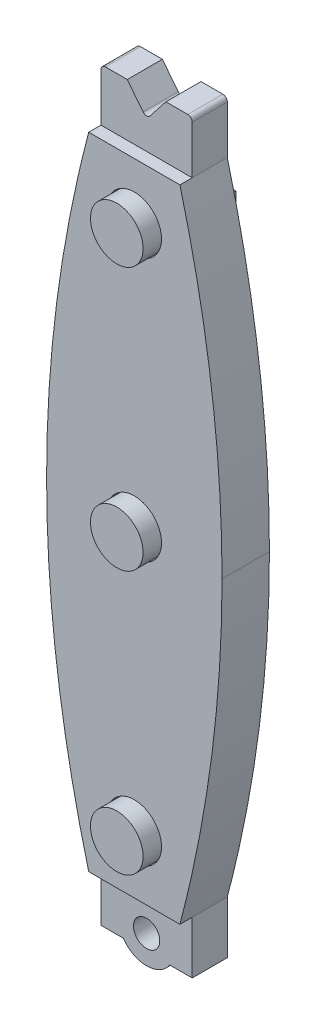
ISO-10303-21;
HEADER;
FILE_DESCRIPTION(('STEP AP214'),'2;1');
FILE_NAME('part.step','',(''),(''),'','','');
FILE_SCHEMA(('AUTOMOTIVE_DESIGN { 1 0 10303 214 1 1 1 1 }'));
ENDSEC;
DATA;
#1=APPLICATION_CONTEXT('core data for automotive mechanical design processes');
#2=APPLICATION_PROTOCOL_DEFINITION('international standard','automotive_design',2000,#1);
#3=PRODUCT_CONTEXT('',#1,'mechanical');
#4=PRODUCT('Part','Part','',(#3));
#5=PRODUCT_RELATED_PRODUCT_CATEGORY('part','',(#4));
#6=PRODUCT_DEFINITION_FORMATION('','',#4);
#7=PRODUCT_DEFINITION_CONTEXT('part definition',#1,'design');
#8=PRODUCT_DEFINITION('design','',#6,#7);
#9=PRODUCT_DEFINITION_SHAPE('','',#8);
#10=(LENGTH_UNIT() NAMED_UNIT(*) SI_UNIT(.MILLI.,.METRE.));
#11=(NAMED_UNIT(*) PLANE_ANGLE_UNIT() SI_UNIT($,.RADIAN.));
#12=(NAMED_UNIT(*) SI_UNIT($,.STERADIAN.) SOLID_ANGLE_UNIT());
#13=UNCERTAINTY_MEASURE_WITH_UNIT(LENGTH_MEASURE(1.E-05),#10,'distance_accuracy_value','');
#14=(GEOMETRIC_REPRESENTATION_CONTEXT(3) GLOBAL_UNCERTAINTY_ASSIGNED_CONTEXT((#13)) GLOBAL_UNIT_ASSIGNED_CONTEXT((#10,
#11,#12)) REPRESENTATION_CONTEXT('',''));
#15=CARTESIAN_POINT('',(0.,0.,0.));
#16=DIRECTION('',(0.,0.,1.));
#17=DIRECTION('',(1.,0.,0.));
#18=AXIS2_PLACEMENT_3D('',#15,#16,#17);
#19=CARTESIAN_POINT('',(0.,0.,0.));
#20=DIRECTION('',(0.,0.,1.));
#21=DIRECTION('',(1.,0.,0.));
#22=AXIS2_PLACEMENT_3D('',#19,#20,#21);
#23=PLANE('',#22);
#24=DIRECTION('',(0.,1.,0.));
#25=VECTOR('',#24,1.);
#26=CARTESIAN_POINT('',(-26.9659834710744,-62.6986404958678,0.));
#27=LINE('',#26,#25);
#28=CARTESIAN_POINT('',(-26.9659834710744,-58.3806404958678,0.));
#29=VERTEX_POINT('',#28);
#30=CARTESIAN_POINT('',(-26.9659834710744,-50.7606404958678,0.));
#31=VERTEX_POINT('',#30);
#32=EDGE_CURVE('E580',#29,#31,#27,.T.);
#33=ORIENTED_EDGE('',*,*,#32,.T.);
#34=CARTESIAN_POINT('',(-26.9659834710744,-50.7606404958678,0.));
#35=CARTESIAN_POINT('',(-33.0619834710744,-27.5831404958678,0.));
#36=CARTESIAN_POINT('',(-33.0619834710744,-4.40564049586777,0.));
#37=B_SPLINE_CURVE_WITH_KNOTS('',2,(#34,#35,#36),.UNSPECIFIED.,.F.,.F.,(3,3),(0.5,1.),.UNSPECIFIED.);
#38=CARTESIAN_POINT('',(-33.0619834710744,-4.40564049586777,0.));
#39=VERTEX_POINT('',#38);
#40=EDGE_CURVE('E220',#31,#39,#37,.T.);
#41=ORIENTED_EDGE('',*,*,#40,.T.);
#42=CARTESIAN_POINT('',(-33.0619834710744,-4.40564049586779,0.));
#43=CARTESIAN_POINT('',(-33.0619834710744,18.7718595041322,0.));
#44=CARTESIAN_POINT('',(-26.9659834710744,41.9493595041322,0.));
#45=B_SPLINE_CURVE_WITH_KNOTS('',2,(#42,#43,#44),.UNSPECIFIED.,.F.,.F.,(3,3),(0.,0.5),.UNSPECIFIED.);
#46=CARTESIAN_POINT('',(-26.9659834710744,41.9493595041322,0.));
#47=VERTEX_POINT('',#46);
#48=EDGE_CURVE('E292',#39,#47,#45,.T.);
#49=ORIENTED_EDGE('',*,*,#48,.T.);
#50=DIRECTION('',(0.,-1.,0.));
#51=VECTOR('',#50,1.);
#52=CARTESIAN_POINT('',(-26.9659834710744,49.5693595041322,0.));
#53=LINE('',#52,#51);
#54=CARTESIAN_POINT('',(-26.9659834710744,48.9343595041322,0.));
#55=VERTEX_POINT('',#54);
#56=EDGE_CURVE('E483',#55,#47,#53,.T.);
#57=ORIENTED_EDGE('',*,*,#56,.F.);
#58=CARTESIAN_POINT('',(-26.3309834710744,48.9343595041322,0.));
#59=DIRECTION('',(0.,0.,1.));
#60=DIRECTION('',(1.,0.,0.));
#61=AXIS2_PLACEMENT_3D('',#58,#59,#60);
#62=CIRCLE('',#61,0.635);
#63=CARTESIAN_POINT('',(-26.3309834710744,49.5693595041322,0.));
#64=VERTEX_POINT('',#63);
#65=EDGE_CURVE('E595',#55,#64,#62,.F.);
#66=ORIENTED_EDGE('',*,*,#65,.T.);
#67=DIRECTION('',(-1.,0.,0.));
#68=VECTOR('',#67,1.);
#69=CARTESIAN_POINT('',(-13.7579834710744,49.5693595041322,0.));
#70=LINE('',#69,#68);
#71=CARTESIAN_POINT('',(-23.1559834710744,49.5693595041322,0.));
#72=VERTEX_POINT('',#71);
#73=EDGE_CURVE('E479',#72,#64,#70,.T.);
#74=ORIENTED_EDGE('',*,*,#73,.F.);
#75=DIRECTION('',(0.617821551931903,-0.786318338822423,0.));
#76=VECTOR('',#75,1.);
#77=CARTESIAN_POINT('',(-23.1559834710744,49.5693595041322,0.));
#78=LINE('',#77,#76);
#79=CARTESIAN_POINT('',(-20.8612956162266,46.6488476888714,0.));
#80=VERTEX_POINT('',#79);
#81=EDGE_CURVE('E458',#72,#80,#78,.T.);
#82=ORIENTED_EDGE('',*,*,#81,.T.);
#83=CARTESIAN_POINT('',(-20.3619834710744,47.0411643743482,0.));
#84=DIRECTION('',(0.,0.,1.));
#85=DIRECTION('',(1.,0.,0.));
#86=AXIS2_PLACEMENT_3D('',#83,#84,#85);
#87=CIRCLE('',#86,0.635);
#88=CARTESIAN_POINT('',(-19.8626713259222,46.6488476888714,0.));
#89=VERTEX_POINT('',#88);
#90=EDGE_CURVE('E11',#80,#89,#87,.T.);
#91=ORIENTED_EDGE('',*,*,#90,.T.);
#92=DIRECTION('',(0.617821551931903,0.786318338822423,0.));
#93=VECTOR('',#92,1.);
#94=CARTESIAN_POINT('',(-20.3619834710744,46.0133595041322,0.));
#95=LINE('',#94,#93);
#96=CARTESIAN_POINT('',(-17.5679834710744,49.5693595041322,0.));
#97=VERTEX_POINT('',#96);
#98=EDGE_CURVE('E455',#89,#97,#95,.T.);
#99=ORIENTED_EDGE('',*,*,#98,.T.);
#100=CARTESIAN_POINT('',(-14.3929834710744,49.5693595041322,0.));
#101=VERTEX_POINT('',#100);
#102=EDGE_CURVE('E481',#101,#97,#70,.T.);
#103=ORIENTED_EDGE('',*,*,#102,.F.);
#104=CARTESIAN_POINT('',(-14.3929834710744,48.9343595041322,0.));
#105=DIRECTION('',(0.,0.,1.));
#106=DIRECTION('',(1.,0.,0.));
#107=AXIS2_PLACEMENT_3D('',#104,#105,#106);
#108=CIRCLE('',#107,0.635);
#109=CARTESIAN_POINT('',(-13.7579834710744,48.9343595041322,0.));
#110=VERTEX_POINT('',#109);
#111=EDGE_CURVE('E593',#101,#110,#108,.F.);
#112=ORIENTED_EDGE('',*,*,#111,.T.);
#113=DIRECTION('',(0.,-1.,0.));
#114=VECTOR('',#113,1.);
#115=CARTESIAN_POINT('',(-13.7579834710744,49.5693595041322,0.));
#116=LINE('',#115,#114);
#117=CARTESIAN_POINT('',(-13.7579834710744,41.9493595041322,0.));
#118=VERTEX_POINT('',#117);
#119=EDGE_CURVE('E494',#110,#118,#116,.T.);
#120=ORIENTED_EDGE('',*,*,#119,.T.);
#121=CARTESIAN_POINT('',(-13.7579834710744,41.9493595041322,0.));
#122=CARTESIAN_POINT('',(-7.6619834710744,18.7718595041322,0.));
#123=CARTESIAN_POINT('',(-7.6619834710744,-4.40564049586779,0.));
#124=B_SPLINE_CURVE_WITH_KNOTS('',2,(#121,#122,#123),.UNSPECIFIED.,.F.,.F.,(3,3),(0.,0.5),.UNSPECIFIED.);
#125=CARTESIAN_POINT('',(-7.6619834710744,-4.4056404958678,0.));
#126=VERTEX_POINT('',#125);
#127=EDGE_CURVE('E473',#118,#126,#124,.T.);
#128=ORIENTED_EDGE('',*,*,#127,.T.);
#129=CARTESIAN_POINT('',(-7.6619834710744,-4.4056404958678,0.));
#130=CARTESIAN_POINT('',(-7.66198347107439,-27.5831404958678,0.));
#131=CARTESIAN_POINT('',(-13.7579834710744,-50.7606404958678,0.));
#132=B_SPLINE_CURVE_WITH_KNOTS('',2,(#129,#130,#131),.UNSPECIFIED.,.F.,.F.,(3,3),(0.,
0.500000000000001),.UNSPECIFIED.);
#133=CARTESIAN_POINT('',(-13.7579834710744,-50.7606404958678,0.));
#134=VERTEX_POINT('',#133);
#135=EDGE_CURVE('E252',#126,#134,#132,.T.);
#136=ORIENTED_EDGE('',*,*,#135,.T.);
#137=DIRECTION('',(0.,1.,0.));
#138=VECTOR('',#137,1.);
#139=CARTESIAN_POINT('',(-13.7579834710744,-62.6986404958678,0.));
#140=LINE('',#139,#138);
#141=CARTESIAN_POINT('',(-13.7579834710744,-58.3806404958678,0.));
#142=VERTEX_POINT('',#141);
#143=EDGE_CURVE('E577',#142,#134,#140,.T.);
#144=ORIENTED_EDGE('',*,*,#143,.F.);
#145=DIRECTION('',(-1.,0.,0.));
#146=VECTOR('',#145,1.);
#147=CARTESIAN_POINT('',(-13.7579834710744,-58.3806404958678,0.));
#148=LINE('',#147,#146);
#149=CARTESIAN_POINT('',(-17.0018793060224,-58.3806404958678,0.));
#150=VERTEX_POINT('',#149);
#151=EDGE_CURVE('E558',#142,#150,#148,.T.);
#152=ORIENTED_EDGE('',*,*,#151,.T.);
#153=CARTESIAN_POINT('',(-20.3619834710744,-56.0946404958678,0.));
#154=DIRECTION('',(0.,0.,-1.));
#155=DIRECTION('',(1.,0.,0.));
#156=AXIS2_PLACEMENT_3D('',#153,#154,#155);
#157=CIRCLE('',#156,4.064);
#158=CARTESIAN_POINT('',(-23.7220876361264,-58.3806404958678,0.));
#159=VERTEX_POINT('',#158);
#160=EDGE_CURVE('E551',#150,#159,#157,.T.);
#161=ORIENTED_EDGE('',*,*,#160,.T.);
#162=DIRECTION('',(-1.,0.,0.));
#163=VECTOR('',#162,1.);
#164=CARTESIAN_POINT('',(-23.7220876361264,-58.3806404958678,0.));
#165=LINE('',#164,#163);
#166=EDGE_CURVE('E554',#159,#29,#165,.T.);
#167=ORIENTED_EDGE('',*,*,#166,.T.);
#168=EDGE_LOOP('',(#33,#41,#49,#57,#66,#74,#82,#91,#99,#103,#112,#120,#128,#136,#144,#152,#161,#167));
#169=FACE_BOUND('',#168,.T.);
#170=CARTESIAN_POINT('',(-20.3619834710744,-56.0946404958678,0.));
#171=DIRECTION('',(0.,0.,1.));
#172=DIRECTION('',(1.,0.,0.));
#173=AXIS2_PLACEMENT_3D('',#170,#171,#172);
#174=CIRCLE('',#173,1.905);
#175=CARTESIAN_POINT('',(-18.4569834710744,-56.0946404958678,0.));
#176=VERTEX_POINT('',#175);
#177=EDGE_CURVE('E545',#176,#176,#174,.T.);
#178=ORIENTED_EDGE('',*,*,#177,.T.);
#179=EDGE_LOOP('',(#178));
#180=FACE_BOUND('',#179,.T.);
#181=DIRECTION('',(0.,1.,0.));
#182=VECTOR('',#181,1.);
#183=CARTESIAN_POINT('',(-26.7119834710744,-45.6806404958678,0.));
#184=LINE('',#183,#182);
#185=CARTESIAN_POINT('',(-26.7119834710744,-45.6806404958678,0.));
#186=VERTEX_POINT('',#185);
#187=CARTESIAN_POINT('',(-26.7119834710744,36.8693595041322,0.));
#188=VERTEX_POINT('',#187);
#189=EDGE_CURVE('E217',#186,#188,#184,.T.);
#190=ORIENTED_EDGE('',*,*,#189,.F.);
#191=DIRECTION('',(-1.,0.,0.));
#192=VECTOR('',#191,1.);
#193=CARTESIAN_POINT('',(-14.0119834710744,-45.6806404958678,0.));
#194=LINE('',#193,#192);
#195=CARTESIAN_POINT('',(-14.0119834710744,-45.6806404958678,0.));
#196=VERTEX_POINT('',#195);
#197=EDGE_CURVE('E214',#196,#186,#194,.T.);
#198=ORIENTED_EDGE('',*,*,#197,.F.);
#199=DIRECTION('',(0.,-1.,0.));
#200=VECTOR('',#199,1.);
#201=CARTESIAN_POINT('',(-14.0119834710744,-45.6806404958678,0.));
#202=LINE('',#201,#200);
#203=CARTESIAN_POINT('',(-14.0119834710744,36.8693595041322,0.));
#204=VERTEX_POINT('',#203);
#205=EDGE_CURVE('E57',#204,#196,#202,.T.);
#206=ORIENTED_EDGE('',*,*,#205,.F.);
#207=DIRECTION('',(1.,0.,0.));
#208=VECTOR('',#207,1.);
#209=CARTESIAN_POINT('',(-14.0119834710744,36.8693595041322,0.));
#210=LINE('',#209,#208);
#211=EDGE_CURVE('E52',#188,#204,#210,.T.);
#212=ORIENTED_EDGE('',*,*,#211,.F.);
#213=EDGE_LOOP('',(#190,#198,#206,#212));
#214=FACE_BOUND('',#213,.T.);
#215=ADVANCED_FACE('F35',(#169,#180,#214),#23,.F.);
#216=CARTESIAN_POINT('',(0.,49.5693595041322,0.));
#217=DIRECTION('',(0.,1.,0.));
#218=DIRECTION('',(0.,0.,1.));
#219=AXIS2_PLACEMENT_3D('',#216,#217,#218);
#220=PLANE('',#219);
#221=DIRECTION('',(1.,0.,0.));
#222=VECTOR('',#221,1.);
#223=CARTESIAN_POINT('',(-13.7579834710744,49.5693595041322,5.08));
#224=LINE('',#223,#222);
#225=CARTESIAN_POINT('',(-17.5679834710744,49.5693595041322,5.08));
#226=VERTEX_POINT('',#225);
#227=CARTESIAN_POINT('',(-14.3929834710744,49.5693595041322,5.08));
#228=VERTEX_POINT('',#227);
#229=EDGE_CURVE('E480',#226,#228,#224,.T.);
#230=ORIENTED_EDGE('',*,*,#229,.T.);
#231=DIRECTION('',(0.,0.,-1.));
#232=VECTOR('',#231,1.);
#233=CARTESIAN_POINT('',(-14.3929834710744,49.5693595041322,0.));
#234=LINE('',#233,#232);
#235=EDGE_CURVE('E599',#228,#101,#234,.T.);
#236=ORIENTED_EDGE('',*,*,#235,.T.);
#237=ORIENTED_EDGE('',*,*,#102,.T.);
#238=DIRECTION('',(0.,0.,1.));
#239=VECTOR('',#238,1.);
#240=CARTESIAN_POINT('',(-17.5679834710744,49.5693595041322,0.));
#241=LINE('',#240,#239);
#242=EDGE_CURVE('E461',#97,#226,#241,.T.);
#243=ORIENTED_EDGE('',*,*,#242,.T.);
#244=EDGE_LOOP('',(#230,#236,#237,#243));
#245=FACE_BOUND('',#244,.T.);
#246=ADVANCED_FACE('F331',(#245),#220,.T.);
#247=CARTESIAN_POINT('',(-33.0619834710744,41.9493595041322,5.08));
#248=DIRECTION('',(0.,-1.,0.));
#249=DIRECTION('',(0.,0.,-1.));
#250=AXIS2_PLACEMENT_3D('',#247,#248,#249);
#251=PLANE('',#250);
#252=DIRECTION('',(1.,0.,0.));
#253=VECTOR('',#252,1.);
#254=CARTESIAN_POINT('',(-13.7579834710744,41.9493595041322,5.08));
#255=LINE('',#254,#253);
#256=CARTESIAN_POINT('',(-26.9659834710744,41.9493595041322,5.08));
#257=VERTEX_POINT('',#256);
#258=CARTESIAN_POINT('',(-13.7579834710744,41.9493595041322,5.08));
#259=VERTEX_POINT('',#258);
#260=EDGE_CURVE('E486',#257,#259,#255,.T.);
#261=ORIENTED_EDGE('',*,*,#260,.F.);
#262=DIRECTION('',(0.,0.,1.));
#263=VECTOR('',#262,1.);
#264=CARTESIAN_POINT('',(-26.9659834710744,41.9493595041322,-0.761999999999999));
#265=LINE('',#264,#263);
#266=CARTESIAN_POINT('',(-26.9659834710744,41.9493595041322,6.858));
#267=VERTEX_POINT('',#266);
#268=EDGE_CURVE('E285',#257,#267,#265,.T.);
#269=ORIENTED_EDGE('',*,*,#268,.T.);
#270=DIRECTION('',(-1.,0.,0.));
#271=VECTOR('',#270,1.);
#272=CARTESIAN_POINT('',(-7.6619834710744,41.9493595041322,6.858));
#273=LINE('',#272,#271);
#274=CARTESIAN_POINT('',(-13.7579834710744,41.9493595041322,6.858));
#275=VERTEX_POINT('',#274);
#276=EDGE_CURVE('E537',#275,#267,#273,.T.);
#277=ORIENTED_EDGE('',*,*,#276,.F.);
#278=DIRECTION('',(0.,0.,1.));
#279=VECTOR('',#278,1.);
#280=CARTESIAN_POINT('',(-13.7579834710744,41.9493595041322,-0.761999999999999));
#281=LINE('',#280,#279);
#282=EDGE_CURVE('E643',#259,#275,#281,.T.);
#283=ORIENTED_EDGE('',*,*,#282,.F.);
#284=EDGE_LOOP('',(#261,#269,#277,#283));
#285=FACE_BOUND('',#284,.T.);
#286=ADVANCED_FACE('F427',(#285),#251,.F.);
#287=CARTESIAN_POINT('',(-33.0619834710744,-50.7606404958678,5.08));
#288=DIRECTION('',(0.,1.,0.));
#289=DIRECTION('',(0.,0.,1.));
#290=AXIS2_PLACEMENT_3D('',#287,#288,#289);
#291=PLANE('',#290);
#292=DIRECTION('',(1.,0.,0.));
#293=VECTOR('',#292,1.);
#294=CARTESIAN_POINT('',(-7.6619834710744,-50.7606404958678,6.858));
#295=LINE('',#294,#293);
#296=CARTESIAN_POINT('',(-26.9659834710744,-50.7606404958678,6.858));
#297=VERTEX_POINT('',#296);
#298=CARTESIAN_POINT('',(-13.7579834710744,-50.7606404958678,6.858));
#299=VERTEX_POINT('',#298);
#300=EDGE_CURVE('E542',#297,#299,#295,.T.);
#301=ORIENTED_EDGE('',*,*,#300,.F.);
#302=DIRECTION('',(0.,0.,1.));
#303=VECTOR('',#302,1.);
#304=CARTESIAN_POINT('',(-26.9659834710744,-50.7606404958678,0.));
#305=LINE('',#304,#303);
#306=CARTESIAN_POINT('',(-26.9659834710744,-50.7606404958678,5.08));
#307=VERTEX_POINT('',#306);
#308=EDGE_CURVE('E230',#307,#297,#305,.T.);
#309=ORIENTED_EDGE('',*,*,#308,.F.);
#310=DIRECTION('',(1.,0.,0.));
#311=VECTOR('',#310,1.);
#312=CARTESIAN_POINT('',(-7.6619834710744,-50.7606404958678,5.08));
#313=LINE('',#312,#311);
#314=CARTESIAN_POINT('',(-13.7579834710744,-50.7606404958678,5.08));
#315=VERTEX_POINT('',#314);
#316=EDGE_CURVE('E583',#307,#315,#313,.T.);
#317=ORIENTED_EDGE('',*,*,#316,.T.);
#318=DIRECTION('',(0.,0.,1.));
#319=VECTOR('',#318,1.);
#320=CARTESIAN_POINT('',(-13.7579834710744,-50.7606404958678,0.));
#321=LINE('',#320,#319);
#322=EDGE_CURVE('E259',#315,#299,#321,.T.);
#323=ORIENTED_EDGE('',*,*,#322,.T.);
#324=EDGE_LOOP('',(#301,#309,#317,#323));
#325=FACE_BOUND('',#324,.T.);
#326=ADVANCED_FACE('F422',(#325),#291,.F.);
#327=CARTESIAN_POINT('',(0.,0.,5.08));
#328=DIRECTION('',(0.,0.,1.));
#329=DIRECTION('',(1.,0.,0.));
#330=AXIS2_PLACEMENT_3D('',#327,#328,#329);
#331=PLANE('',#330);
#332=ORIENTED_EDGE('',*,*,#316,.F.);
#333=DIRECTION('',(0.,1.,0.));
#334=VECTOR('',#333,1.);
#335=CARTESIAN_POINT('',(-26.9659834710744,-62.6986404958678,5.08));
#336=LINE('',#335,#334);
#337=CARTESIAN_POINT('',(-26.9659834710744,-58.3806404958678,5.08));
#338=VERTEX_POINT('',#337);
#339=EDGE_CURVE('E607',#338,#307,#336,.T.);
#340=ORIENTED_EDGE('',*,*,#339,.F.);
#341=DIRECTION('',(-1.,0.,0.));
#342=VECTOR('',#341,1.);
#343=CARTESIAN_POINT('',(-23.7220876361264,-58.3806404958678,5.08));
#344=LINE('',#343,#342);
#345=CARTESIAN_POINT('',(-23.7220876361264,-58.3806404958678,5.08));
#346=VERTEX_POINT('',#345);
#347=EDGE_CURVE('E564',#346,#338,#344,.T.);
#348=ORIENTED_EDGE('',*,*,#347,.F.);
#349=CARTESIAN_POINT('',(-20.3619834710744,-56.0946404958678,5.08));
#350=DIRECTION('',(0.,0.,-1.));
#351=DIRECTION('',(1.,0.,0.));
#352=AXIS2_PLACEMENT_3D('',#349,#350,#351);
#353=CIRCLE('',#352,4.064);
#354=CARTESIAN_POINT('',(-17.0018793060224,-58.3806404958678,5.08));
#355=VERTEX_POINT('',#354);
#356=EDGE_CURVE('E548',#355,#346,#353,.T.);
#357=ORIENTED_EDGE('',*,*,#356,.F.);
#358=DIRECTION('',(-1.,0.,0.));
#359=VECTOR('',#358,1.);
#360=CARTESIAN_POINT('',(-13.7579834710744,-58.3806404958678,5.08));
#361=LINE('',#360,#359);
#362=CARTESIAN_POINT('',(-13.7579834710744,-58.3806404958678,5.08));
#363=VERTEX_POINT('',#362);
#364=EDGE_CURVE('E555',#363,#355,#361,.T.);
#365=ORIENTED_EDGE('',*,*,#364,.F.);
#366=DIRECTION('',(0.,1.,0.));
#367=VECTOR('',#366,1.);
#368=CARTESIAN_POINT('',(-13.7579834710744,-62.6986404958678,5.08));
#369=LINE('',#368,#367);
#370=EDGE_CURVE('E581',#363,#315,#369,.T.);
#371=ORIENTED_EDGE('',*,*,#370,.T.);
#372=EDGE_LOOP('',(#332,#340,#348,#357,#365,#371));
#373=FACE_BOUND('',#372,.T.);
#374=CARTESIAN_POINT('',(-20.3619834710744,-56.0946404958678,5.08));
#375=DIRECTION('',(0.,0.,1.));
#376=DIRECTION('',(1.,0.,0.));
#377=AXIS2_PLACEMENT_3D('',#374,#375,#376);
#378=CIRCLE('',#377,1.905);
#379=CARTESIAN_POINT('',(-18.4569834710744,-56.0946404958678,5.08));
#380=VERTEX_POINT('',#379);
#381=EDGE_CURVE('E544',#380,#380,#378,.T.);
#382=ORIENTED_EDGE('',*,*,#381,.F.);
#383=EDGE_LOOP('',(#382));
#384=FACE_BOUND('',#383,.T.);
#385=ADVANCED_FACE('F418',(#373,#384),#331,.T.);
#386=CARTESIAN_POINT('',(-26.9659834710744,-62.6986404958678,5.08));
#387=DIRECTION('',(1.,0.,0.));
#388=DIRECTION('',(0.,0.,-1.));
#389=AXIS2_PLACEMENT_3D('',#386,#387,#388);
#390=PLANE('',#389);
#391=ORIENTED_EDGE('',*,*,#32,.F.);
#392=DIRECTION('',(0.,0.,1.));
#393=VECTOR('',#392,1.);
#394=CARTESIAN_POINT('',(-26.9659834710744,-58.3806404958678,0.));
#395=LINE('',#394,#393);
#396=EDGE_CURVE('E573',#29,#338,#395,.T.);
#397=ORIENTED_EDGE('',*,*,#396,.T.);
#398=ORIENTED_EDGE('',*,*,#339,.T.);
#399=DIRECTION('',(0.,0.,-1.));
#400=VECTOR('',#399,1.);
#401=CARTESIAN_POINT('',(-26.9659834710744,-50.7606404958678,5.08));
#402=LINE('',#401,#400);
#403=EDGE_CURVE('E570',#307,#31,#402,.T.);
#404=ORIENTED_EDGE('',*,*,#403,.T.);
#405=EDGE_LOOP('',(#391,#397,#398,#404));
#406=FACE_BOUND('',#405,.T.);
#407=ADVANCED_FACE('F414',(#406),#390,.F.);
#408=CARTESIAN_POINT('',(-13.7579834710744,-62.6986404958678,5.08));
#409=DIRECTION('',(-1.,0.,0.));
#410=DIRECTION('',(0.,0.,1.));
#411=AXIS2_PLACEMENT_3D('',#408,#409,#410);
#412=PLANE('',#411);
#413=ORIENTED_EDGE('',*,*,#370,.F.);
#414=DIRECTION('',(0.,0.,1.));
#415=VECTOR('',#414,1.);
#416=CARTESIAN_POINT('',(-13.7579834710744,-58.3806404958678,0.));
#417=LINE('',#416,#415);
#418=EDGE_CURVE('E571',#142,#363,#417,.T.);
#419=ORIENTED_EDGE('',*,*,#418,.F.);
#420=ORIENTED_EDGE('',*,*,#143,.T.);
#421=DIRECTION('',(0.,0.,1.));
#422=VECTOR('',#421,1.);
#423=CARTESIAN_POINT('',(-13.7579834710744,-50.7606404958678,5.08));
#424=LINE('',#423,#422);
#425=EDGE_CURVE('E610',#134,#315,#424,.T.);
#426=ORIENTED_EDGE('',*,*,#425,.T.);
#427=EDGE_LOOP('',(#413,#419,#420,#426));
#428=FACE_BOUND('',#427,.T.);
#429=ADVANCED_FACE('F410',(#428),#412,.F.);
#430=CARTESIAN_POINT('',(-20.3619834710744,-56.0946404958678,0.));
#431=DIRECTION('',(0.,0.,1.));
#432=DIRECTION('',(1.,0.,0.));
#433=AXIS2_PLACEMENT_3D('',#430,#431,#432);
#434=CYLINDRICAL_SURFACE('',#433,4.064);
#435=ORIENTED_EDGE('',*,*,#356,.T.);
#436=DIRECTION('',(0.,0.,1.));
#437=VECTOR('',#436,1.);
#438=CARTESIAN_POINT('',(-23.7220876361264,-58.3806404958678,0.));
#439=LINE('',#438,#437);
#440=EDGE_CURVE('E561',#159,#346,#439,.T.);
#441=ORIENTED_EDGE('',*,*,#440,.F.);
#442=ORIENTED_EDGE('',*,*,#160,.F.);
#443=DIRECTION('',(0.,0.,1.));
#444=VECTOR('',#443,1.);
#445=CARTESIAN_POINT('',(-17.0018793060224,-58.3806404958678,0.));
#446=LINE('',#445,#444);
#447=EDGE_CURVE('E568',#150,#355,#446,.T.);
#448=ORIENTED_EDGE('',*,*,#447,.T.);
#449=EDGE_LOOP('',(#435,#441,#442,#448));
#450=FACE_BOUND('',#449,.T.);
#451=ADVANCED_FACE('F403',(#450),#434,.T.);
#452=CARTESIAN_POINT('',(-13.7579834710744,-58.3806404958678,0.));
#453=DIRECTION('',(0.,1.,0.));
#454=DIRECTION('',(0.,0.,1.));
#455=AXIS2_PLACEMENT_3D('',#452,#453,#454);
#456=PLANE('',#455);
#457=ORIENTED_EDGE('',*,*,#364,.T.);
#458=ORIENTED_EDGE('',*,*,#447,.F.);
#459=ORIENTED_EDGE('',*,*,#151,.F.);
#460=ORIENTED_EDGE('',*,*,#418,.T.);
#461=EDGE_LOOP('',(#457,#458,#459,#460));
#462=FACE_BOUND('',#461,.T.);
#463=ADVANCED_FACE('F400',(#462),#456,.F.);
#464=CARTESIAN_POINT('',(-23.7220876361264,-58.3806404958678,0.));
#465=DIRECTION('',(0.,1.,0.));
#466=DIRECTION('',(0.,0.,1.));
#467=AXIS2_PLACEMENT_3D('',#464,#465,#466);
#468=PLANE('',#467);
#469=ORIENTED_EDGE('',*,*,#347,.T.);
#470=ORIENTED_EDGE('',*,*,#396,.F.);
#471=ORIENTED_EDGE('',*,*,#166,.F.);
#472=ORIENTED_EDGE('',*,*,#440,.T.);
#473=EDGE_LOOP('',(#469,#470,#471,#472));
#474=FACE_BOUND('',#473,.T.);
#475=ADVANCED_FACE('F398',(#474),#468,.F.);
#476=CARTESIAN_POINT('',(-20.3619834710744,-56.0946404958678,0.));
#477=DIRECTION('',(0.,0.,1.));
#478=DIRECTION('',(1.,0.,0.));
#479=AXIS2_PLACEMENT_3D('',#476,#477,#478);
#480=CYLINDRICAL_SURFACE('',#479,1.905);
#481=ORIENTED_EDGE('',*,*,#177,.F.);
#482=EDGE_LOOP('',(#481));
#483=FACE_BOUND('',#482,.T.);
#484=ORIENTED_EDGE('',*,*,#381,.T.);
#485=EDGE_LOOP('',(#484));
#486=FACE_BOUND('',#485,.T.);
#487=ADVANCED_FACE('F394',(#483,#486),#480,.F.);
#488=CARTESIAN_POINT('',(0.,0.,6.858));
#489=DIRECTION('',(0.,0.,1.));
#490=DIRECTION('',(1.,0.,0.));
#491=AXIS2_PLACEMENT_3D('',#488,#489,#490);
#492=PLANE('',#491);
#493=CARTESIAN_POINT('',(-26.9659834710744,-50.7606404958678,6.858));
#494=CARTESIAN_POINT('',(-33.0619834710744,-27.5831404958678,6.858));
#495=CARTESIAN_POINT('',(-33.0619834710744,-4.40564049586777,6.858));
#496=B_SPLINE_CURVE_WITH_KNOTS('',2,(#493,#494,#495),.UNSPECIFIED.,.F.,.F.,(3,3),(0.5,1.),.UNSPECIFIED.);
#497=CARTESIAN_POINT('',(-33.0619834710744,-4.40564049586777,6.858));
#498=VERTEX_POINT('',#497);
#499=EDGE_CURVE('E218',#297,#498,#496,.T.);
#500=ORIENTED_EDGE('',*,*,#499,.F.);
#501=ORIENTED_EDGE('',*,*,#300,.T.);
#502=CARTESIAN_POINT('',(-7.6619834710744,-4.4056404958678,6.858));
#503=CARTESIAN_POINT('',(-7.66198347107439,-27.5831404958678,6.858));
#504=CARTESIAN_POINT('',(-13.7579834710744,-50.7606404958678,6.858));
#505=B_SPLINE_CURVE_WITH_KNOTS('',2,(#502,#503,#504),.UNSPECIFIED.,.F.,.F.,(3,3),(0.,
0.500000000000001),.UNSPECIFIED.);
#506=CARTESIAN_POINT('',(-7.6619834710744,-4.4056404958678,6.858));
#507=VERTEX_POINT('',#506);
#508=EDGE_CURVE('E260',#507,#299,#505,.T.);
#509=ORIENTED_EDGE('',*,*,#508,.F.);
#510=CARTESIAN_POINT('',(-13.7579834710744,41.9493595041322,6.858));
#511=CARTESIAN_POINT('',(-7.6619834710744,18.7718595041322,6.858));
#512=CARTESIAN_POINT('',(-7.6619834710744,-4.40564049586779,6.858));
#513=B_SPLINE_CURVE_WITH_KNOTS('',2,(#510,#511,#512),.UNSPECIFIED.,.F.,.F.,(3,3),(0.,0.5),.UNSPECIFIED.);
#514=EDGE_CURVE('E299',#275,#507,#513,.T.);
#515=ORIENTED_EDGE('',*,*,#514,.F.);
#516=ORIENTED_EDGE('',*,*,#276,.T.);
#517=CARTESIAN_POINT('',(-33.0619834710744,-4.40564049586779,6.858));
#518=CARTESIAN_POINT('',(-33.0619834710744,18.7718595041322,6.858));
#519=CARTESIAN_POINT('',(-26.9659834710744,41.9493595041322,6.858));
#520=B_SPLINE_CURVE_WITH_KNOTS('',2,(#517,#518,#519),.UNSPECIFIED.,.F.,.F.,(3,3),(0.,0.5),.UNSPECIFIED.);
#521=EDGE_CURVE('E274',#498,#267,#520,.T.);
#522=ORIENTED_EDGE('',*,*,#521,.F.);
#523=EDGE_LOOP('',(#500,#501,#509,#515,#516,#522));
#524=FACE_BOUND('',#523,.T.);
#525=CARTESIAN_POINT('',(-20.3619834710744,-4.27864049586779,6.858));
#526=DIRECTION('',(0.,0.,1.));
#527=DIRECTION('',(1.,0.,0.));
#528=AXIS2_PLACEMENT_3D('',#525,#526,#527);
#529=CIRCLE('',#528,3.937);
#530=CARTESIAN_POINT('',(-16.4249834710744,-4.27864049586779,6.858));
#531=VERTEX_POINT('',#530);
#532=EDGE_CURVE('E526',#531,#531,#529,.T.);
#533=ORIENTED_EDGE('',*,*,#532,.F.);
#534=EDGE_LOOP('',(#533));
#535=FACE_BOUND('',#534,.T.);
#536=CARTESIAN_POINT('',(-20.3619834710744,33.8213595041322,6.858));
#537=DIRECTION('',(0.,0.,1.));
#538=DIRECTION('',(1.,0.,0.));
#539=AXIS2_PLACEMENT_3D('',#536,#537,#538);
#540=CIRCLE('',#539,3.937);
#541=CARTESIAN_POINT('',(-16.4249834710744,33.8213595041322,6.858));
#542=VERTEX_POINT('',#541);
#543=EDGE_CURVE('E519',#542,#542,#540,.T.);
#544=ORIENTED_EDGE('',*,*,#543,.F.);
#545=EDGE_LOOP('',(#544));
#546=FACE_BOUND('',#545,.T.);
#547=CARTESIAN_POINT('',(-20.3619834710744,-42.3786404958678,6.858));
#548=DIRECTION('',(0.,0.,1.));
#549=DIRECTION('',(1.,0.,0.));
#550=AXIS2_PLACEMENT_3D('',#547,#548,#549);
#551=CIRCLE('',#550,3.937);
#552=CARTESIAN_POINT('',(-16.4249834710744,-42.3786404958678,6.858));
#553=VERTEX_POINT('',#552);
#554=EDGE_CURVE('E525',#553,#553,#551,.T.);
#555=ORIENTED_EDGE('',*,*,#554,.F.);
#556=EDGE_LOOP('',(#555));
#557=FACE_BOUND('',#556,.T.);
#558=ADVANCED_FACE('F390',(#524,#535,#546,#557),#492,.T.);
#559=CARTESIAN_POINT('',(-20.3619834710744,-42.3786404958678,5.588));
#560=DIRECTION('',(0.,0.,1.));
#561=DIRECTION('',(1.,0.,0.));
#562=AXIS2_PLACEMENT_3D('',#559,#560,#561);
#563=CYLINDRICAL_SURFACE('',#562,3.937);
#564=CARTESIAN_POINT('',(-20.3619834710744,-42.3786404958678,5.588));
#565=DIRECTION('',(0.,0.,1.));
#566=DIRECTION('',(1.,0.,0.));
#567=AXIS2_PLACEMENT_3D('',#564,#565,#566);
#568=CIRCLE('',#567,3.937);
#569=CARTESIAN_POINT('',(-16.4249834710744,-42.3786404958678,5.588));
#570=VERTEX_POINT('',#569);
#571=EDGE_CURVE('E534',#570,#570,#568,.T.);
#572=ORIENTED_EDGE('',*,*,#571,.F.);
#573=EDGE_LOOP('',(#572));
#574=FACE_BOUND('',#573,.T.);
#575=ORIENTED_EDGE('',*,*,#554,.T.);
#576=EDGE_LOOP('',(#575));
#577=FACE_BOUND('',#576,.T.);
#578=ADVANCED_FACE('F386',(#574,#577),#563,.F.);
#579=CARTESIAN_POINT('',(-20.3619834710744,-42.3786404958678,5.588));
#580=DIRECTION('',(0.,0.,1.));
#581=DIRECTION('',(1.,0.,0.));
#582=AXIS2_PLACEMENT_3D('',#579,#580,#581);
#583=PLANE('',#582);
#584=CARTESIAN_POINT('',(-20.3619834710744,-42.3786404958678,5.588));
#585=DIRECTION('',(0.,0.,1.));
#586=DIRECTION('',(1.,0.,0.));
#587=AXIS2_PLACEMENT_3D('',#584,#585,#586);
#588=CIRCLE('',#587,3.81);
#589=CARTESIAN_POINT('',(-16.5519834710744,-42.3786404958678,5.588));
#590=VERTEX_POINT('',#589);
#591=EDGE_CURVE('E513',#590,#590,#588,.T.);
#592=ORIENTED_EDGE('',*,*,#591,.F.);
#593=EDGE_LOOP('',(#592));
#594=FACE_BOUND('',#593,.T.);
#595=ORIENTED_EDGE('',*,*,#571,.T.);
#596=EDGE_LOOP('',(#595));
#597=FACE_BOUND('',#596,.T.);
#598=ADVANCED_FACE('F382',(#594,#597),#583,.T.);
#599=CARTESIAN_POINT('',(-20.3619834710744,33.8213595041322,5.588));
#600=DIRECTION('',(0.,0.,1.));
#601=DIRECTION('',(1.,0.,0.));
#602=AXIS2_PLACEMENT_3D('',#599,#600,#601);
#603=CYLINDRICAL_SURFACE('',#602,3.937);
#604=CARTESIAN_POINT('',(-20.3619834710744,33.8213595041322,5.588));
#605=DIRECTION('',(0.,0.,1.));
#606=DIRECTION('',(1.,0.,0.));
#607=AXIS2_PLACEMENT_3D('',#604,#605,#606);
#608=CIRCLE('',#607,3.937);
#609=CARTESIAN_POINT('',(-16.4249834710744,33.8213595041322,5.588));
#610=VERTEX_POINT('',#609);
#611=EDGE_CURVE('E529',#610,#610,#608,.T.);
#612=ORIENTED_EDGE('',*,*,#611,.F.);
#613=EDGE_LOOP('',(#612));
#614=FACE_BOUND('',#613,.T.);
#615=ORIENTED_EDGE('',*,*,#543,.T.);
#616=EDGE_LOOP('',(#615));
#617=FACE_BOUND('',#616,.T.);
#618=ADVANCED_FACE('F378',(#614,#617),#603,.F.);
#619=CARTESIAN_POINT('',(-20.3619834710744,33.8213595041322,5.588));
#620=DIRECTION('',(0.,0.,1.));
#621=DIRECTION('',(1.,0.,0.));
#622=AXIS2_PLACEMENT_3D('',#619,#620,#621);
#623=PLANE('',#622);
#624=CARTESIAN_POINT('',(-20.3619834710744,33.8213595041322,5.588));
#625=DIRECTION('',(0.,0.,1.));
#626=DIRECTION('',(1.,0.,0.));
#627=AXIS2_PLACEMENT_3D('',#624,#625,#626);
#628=CIRCLE('',#627,3.81);
#629=CARTESIAN_POINT('',(-16.5519834710744,33.8213595041322,5.588));
#630=VERTEX_POINT('',#629);
#631=EDGE_CURVE('E503',#630,#630,#628,.T.);
#632=ORIENTED_EDGE('',*,*,#631,.F.);
#633=EDGE_LOOP('',(#632));
#634=FACE_BOUND('',#633,.T.);
#635=ORIENTED_EDGE('',*,*,#611,.T.);
#636=EDGE_LOOP('',(#635));
#637=FACE_BOUND('',#636,.T.);
#638=ADVANCED_FACE('F374',(#634,#637),#623,.T.);
#639=CARTESIAN_POINT('',(-20.3619834710744,-4.27864049586779,5.588));
#640=DIRECTION('',(0.,0.,1.));
#641=DIRECTION('',(1.,0.,0.));
#642=AXIS2_PLACEMENT_3D('',#639,#640,#641);
#643=CYLINDRICAL_SURFACE('',#642,3.937);
#644=CARTESIAN_POINT('',(-20.3619834710744,-4.27864049586779,5.588));
#645=DIRECTION('',(0.,0.,1.));
#646=DIRECTION('',(1.,0.,0.));
#647=AXIS2_PLACEMENT_3D('',#644,#645,#646);
#648=CIRCLE('',#647,3.937);
#649=CARTESIAN_POINT('',(-16.4249834710744,-4.27864049586779,5.588));
#650=VERTEX_POINT('',#649);
#651=EDGE_CURVE('E522',#650,#650,#648,.T.);
#652=ORIENTED_EDGE('',*,*,#651,.F.);
#653=EDGE_LOOP('',(#652));
#654=FACE_BOUND('',#653,.T.);
#655=ORIENTED_EDGE('',*,*,#532,.T.);
#656=EDGE_LOOP('',(#655));
#657=FACE_BOUND('',#656,.T.);
#658=ADVANCED_FACE('F370',(#654,#657),#643,.F.);
#659=CARTESIAN_POINT('',(-20.3619834710744,-4.27864049586779,5.588));
#660=DIRECTION('',(0.,0.,1.));
#661=DIRECTION('',(1.,0.,0.));
#662=AXIS2_PLACEMENT_3D('',#659,#660,#661);
#663=PLANE('',#662);
#664=CARTESIAN_POINT('',(-20.3619834710744,-4.27864049586779,5.588));
#665=DIRECTION('',(0.,0.,1.));
#666=DIRECTION('',(1.,0.,0.));
#667=AXIS2_PLACEMENT_3D('',#664,#665,#666);
#668=CIRCLE('',#667,3.81);
#669=CARTESIAN_POINT('',(-16.5519834710744,-4.27864049586779,5.588));
#670=VERTEX_POINT('',#669);
#671=EDGE_CURVE('E507',#670,#670,#668,.T.);
#672=ORIENTED_EDGE('',*,*,#671,.F.);
#673=EDGE_LOOP('',(#672));
#674=FACE_BOUND('',#673,.T.);
#675=ORIENTED_EDGE('',*,*,#651,.T.);
#676=EDGE_LOOP('',(#675));
#677=FACE_BOUND('',#676,.T.);
#678=ADVANCED_FACE('F366',(#674,#677),#663,.T.);
#679=CARTESIAN_POINT('',(-20.3619834710744,-42.3786404958678,9.398));
#680=DIRECTION('',(0.,0.,-1.));
#681=DIRECTION('',(-1.,0.,0.));
#682=AXIS2_PLACEMENT_3D('',#679,#680,#681);
#683=CYLINDRICAL_SURFACE('',#682,3.81);
#684=CARTESIAN_POINT('',(-20.3619834710744,-42.3786404958678,9.398));
#685=DIRECTION('',(0.,0.,1.));
#686=DIRECTION('',(1.,0.,0.));
#687=AXIS2_PLACEMENT_3D('',#684,#685,#686);
#688=CIRCLE('',#687,3.81);
#689=CARTESIAN_POINT('',(-16.5519834710744,-42.3786404958678,9.398));
#690=VERTEX_POINT('',#689);
#691=EDGE_CURVE('E516',#690,#690,#688,.T.);
#692=ORIENTED_EDGE('',*,*,#691,.F.);
#693=EDGE_LOOP('',(#692));
#694=FACE_BOUND('',#693,.T.);
#695=ORIENTED_EDGE('',*,*,#591,.T.);
#696=EDGE_LOOP('',(#695));
#697=FACE_BOUND('',#696,.T.);
#698=ADVANCED_FACE('F362',(#694,#697),#683,.T.);
#699=CARTESIAN_POINT('',(-20.3619834710744,-42.3786404958678,9.398));
#700=DIRECTION('',(0.,0.,1.));
#701=DIRECTION('',(1.,0.,0.));
#702=AXIS2_PLACEMENT_3D('',#699,#700,#701);
#703=PLANE('',#702);
#704=ORIENTED_EDGE('',*,*,#691,.T.);
#705=EDGE_LOOP('',(#704));
#706=FACE_BOUND('',#705,.T.);
#707=ADVANCED_FACE('F358',(#706),#703,.T.);
#708=CARTESIAN_POINT('',(-20.3619834710744,-4.27864049586779,9.398));
#709=DIRECTION('',(0.,0.,-1.));
#710=DIRECTION('',(-1.,0.,0.));
#711=AXIS2_PLACEMENT_3D('',#708,#709,#710);
#712=CYLINDRICAL_SURFACE('',#711,3.81);
#713=CARTESIAN_POINT('',(-20.3619834710744,-4.27864049586779,9.398));
#714=DIRECTION('',(0.,0.,1.));
#715=DIRECTION('',(1.,0.,0.));
#716=AXIS2_PLACEMENT_3D('',#713,#714,#715);
#717=CIRCLE('',#716,3.81);
#718=CARTESIAN_POINT('',(-16.5519834710744,-4.27864049586779,9.398));
#719=VERTEX_POINT('',#718);
#720=EDGE_CURVE('E510',#719,#719,#717,.T.);
#721=ORIENTED_EDGE('',*,*,#720,.F.);
#722=EDGE_LOOP('',(#721));
#723=FACE_BOUND('',#722,.T.);
#724=ORIENTED_EDGE('',*,*,#671,.T.);
#725=EDGE_LOOP('',(#724));
#726=FACE_BOUND('',#725,.T.);
#727=ADVANCED_FACE('F354',(#723,#726),#712,.T.);
#728=CARTESIAN_POINT('',(-20.3619834710744,-4.27864049586779,9.398));
#729=DIRECTION('',(0.,0.,1.));
#730=DIRECTION('',(1.,0.,0.));
#731=AXIS2_PLACEMENT_3D('',#728,#729,#730);
#732=PLANE('',#731);
#733=ORIENTED_EDGE('',*,*,#720,.T.);
#734=EDGE_LOOP('',(#733));
#735=FACE_BOUND('',#734,.T.);
#736=ADVANCED_FACE('F350',(#735),#732,.T.);
#737=CARTESIAN_POINT('',(-20.3619834710744,33.8213595041322,9.398));
#738=DIRECTION('',(0.,0.,-1.));
#739=DIRECTION('',(-1.,0.,0.));
#740=AXIS2_PLACEMENT_3D('',#737,#738,#739);
#741=CYLINDRICAL_SURFACE('',#740,3.81);
#742=CARTESIAN_POINT('',(-20.3619834710744,33.8213595041322,9.398));
#743=DIRECTION('',(0.,0.,1.));
#744=DIRECTION('',(1.,0.,0.));
#745=AXIS2_PLACEMENT_3D('',#742,#743,#744);
#746=CIRCLE('',#745,3.81);
#747=CARTESIAN_POINT('',(-16.5519834710744,33.8213595041322,9.398));
#748=VERTEX_POINT('',#747);
#749=EDGE_CURVE('E504',#748,#748,#746,.T.);
#750=ORIENTED_EDGE('',*,*,#749,.F.);
#751=EDGE_LOOP('',(#750));
#752=FACE_BOUND('',#751,.T.);
#753=ORIENTED_EDGE('',*,*,#631,.T.);
#754=EDGE_LOOP('',(#753));
#755=FACE_BOUND('',#754,.T.);
#756=ADVANCED_FACE('F346',(#752,#755),#741,.T.);
#757=CARTESIAN_POINT('',(-20.3619834710744,33.8213595041322,9.398));
#758=DIRECTION('',(0.,0.,1.));
#759=DIRECTION('',(1.,0.,0.));
#760=AXIS2_PLACEMENT_3D('',#757,#758,#759);
#761=PLANE('',#760);
#762=ORIENTED_EDGE('',*,*,#749,.T.);
#763=EDGE_LOOP('',(#762));
#764=FACE_BOUND('',#763,.T.);
#765=ADVANCED_FACE('F342',(#764),#761,.T.);
#766=CARTESIAN_POINT('',(-26.9659834710744,49.5693595041322,5.08));
#767=DIRECTION('',(1.,0.,0.));
#768=DIRECTION('',(0.,0.,-1.));
#769=AXIS2_PLACEMENT_3D('',#766,#767,#768);
#770=PLANE('',#769);
#771=DIRECTION('',(0.,-1.,0.));
#772=VECTOR('',#771,1.);
#773=CARTESIAN_POINT('',(-26.9659834710744,49.5693595041322,5.08));
#774=LINE('',#773,#772);
#775=CARTESIAN_POINT('',(-26.9659834710744,48.9343595041322,5.08));
#776=VERTEX_POINT('',#775);
#777=EDGE_CURVE('E500',#776,#257,#774,.T.);
#778=ORIENTED_EDGE('',*,*,#777,.F.);
#779=DIRECTION('',(0.,0.,1.));
#780=VECTOR('',#779,1.);
#781=CARTESIAN_POINT('',(-26.9659834710744,48.9343595041322,0.));
#782=LINE('',#781,#780);
#783=EDGE_CURVE('E591',#776,#55,#782,.F.);
#784=ORIENTED_EDGE('',*,*,#783,.T.);
#785=ORIENTED_EDGE('',*,*,#56,.T.);
#786=DIRECTION('',(0.,0.,1.));
#787=VECTOR('',#786,1.);
#788=CARTESIAN_POINT('',(-26.9659834710744,41.9493595041322,5.08));
#789=LINE('',#788,#787);
#790=EDGE_CURVE('E475',#47,#257,#789,.T.);
#791=ORIENTED_EDGE('',*,*,#790,.T.);
#792=EDGE_LOOP('',(#778,#784,#785,#791));
#793=FACE_BOUND('',#792,.T.);
#794=ADVANCED_FACE('F338',(#793),#770,.F.);
#795=CARTESIAN_POINT('',(-13.7579834710744,49.5693595041322,5.08));
#796=DIRECTION('',(0.,0.,-1.));
#797=DIRECTION('',(-1.,0.,0.));
#798=AXIS2_PLACEMENT_3D('',#795,#796,#797);
#799=PLANE('',#798);
#800=CARTESIAN_POINT('',(-26.3309834710744,49.5693595041322,5.08));
#801=VERTEX_POINT('',#800);
#802=CARTESIAN_POINT('',(-23.1559834710744,49.5693595041322,5.08));
#803=VERTEX_POINT('',#802);
#804=EDGE_CURVE('E477',#801,#803,#224,.T.);
#805=ORIENTED_EDGE('',*,*,#804,.F.);
#806=CARTESIAN_POINT('',(-26.3309834710744,48.9343595041322,5.08));
#807=DIRECTION('',(0.,0.,-1.));
#808=DIRECTION('',(-1.,0.,0.));
#809=AXIS2_PLACEMENT_3D('',#806,#807,#808);
#810=CIRCLE('',#809,0.635);
#811=EDGE_CURVE('E589',#801,#776,#810,.F.);
#812=ORIENTED_EDGE('',*,*,#811,.T.);
#813=ORIENTED_EDGE('',*,*,#777,.T.);
#814=ORIENTED_EDGE('',*,*,#260,.T.);
#815=DIRECTION('',(0.,-1.,0.));
#816=VECTOR('',#815,1.);
#817=CARTESIAN_POINT('',(-13.7579834710744,49.5693595041322,5.08));
#818=LINE('',#817,#816);
#819=CARTESIAN_POINT('',(-13.7579834710744,48.9343595041322,5.08));
#820=VERTEX_POINT('',#819);
#821=EDGE_CURVE('E497',#820,#259,#818,.T.);
#822=ORIENTED_EDGE('',*,*,#821,.F.);
#823=CARTESIAN_POINT('',(-14.3929834710744,48.9343595041322,5.08));
#824=DIRECTION('',(0.,0.,-1.));
#825=DIRECTION('',(-1.,0.,0.));
#826=AXIS2_PLACEMENT_3D('',#823,#824,#825);
#827=CIRCLE('',#826,0.635);
#828=EDGE_CURVE('E587',#820,#228,#827,.F.);
#829=ORIENTED_EDGE('',*,*,#828,.T.);
#830=ORIENTED_EDGE('',*,*,#229,.F.);
#831=DIRECTION('',(0.617821551931903,0.786318338822423,0.));
#832=VECTOR('',#831,1.);
#833=CARTESIAN_POINT('',(-20.3619834710744,46.0133595041322,5.08));
#834=LINE('',#833,#832);
#835=CARTESIAN_POINT('',(-19.8626713259222,46.6488476888714,5.08));
#836=VERTEX_POINT('',#835);
#837=EDGE_CURVE('E466',#836,#226,#834,.T.);
#838=ORIENTED_EDGE('',*,*,#837,.F.);
#839=CARTESIAN_POINT('',(-20.3619834710744,47.0411643743482,5.08));
#840=DIRECTION('',(0.,0.,-1.));
#841=DIRECTION('',(-1.,0.,0.));
#842=AXIS2_PLACEMENT_3D('',#839,#840,#841);
#843=CIRCLE('',#842,0.635);
#844=CARTESIAN_POINT('',(-20.8612956162266,46.6488476888714,5.08));
#845=VERTEX_POINT('',#844);
#846=EDGE_CURVE('E44',#836,#845,#843,.T.);
#847=ORIENTED_EDGE('',*,*,#846,.T.);
#848=DIRECTION('',(0.617821551931903,-0.786318338822423,0.));
#849=VECTOR('',#848,1.);
#850=CARTESIAN_POINT('',(-23.1559834710744,49.5693595041322,5.08));
#851=LINE('',#850,#849);
#852=EDGE_CURVE('E470',#803,#845,#851,.T.);
#853=ORIENTED_EDGE('',*,*,#852,.F.);
#854=EDGE_LOOP('',(#805,#812,#813,#814,#822,#829,#830,#838,#847,#853));
#855=FACE_BOUND('',#854,.T.);
#856=ADVANCED_FACE('F334',(#855),#799,.F.);
#857=CARTESIAN_POINT('',(-13.7579834710744,49.5693595041322,5.08));
#858=DIRECTION('',(-1.,0.,0.));
#859=DIRECTION('',(0.,0.,1.));
#860=AXIS2_PLACEMENT_3D('',#857,#858,#859);
#861=PLANE('',#860);
#862=ORIENTED_EDGE('',*,*,#119,.F.);
#863=DIRECTION('',(0.,0.,-1.));
#864=VECTOR('',#863,1.);
#865=CARTESIAN_POINT('',(-13.7579834710744,48.9343595041322,5.08));
#866=LINE('',#865,#864);
#867=EDGE_CURVE('E602',#110,#820,#866,.F.);
#868=ORIENTED_EDGE('',*,*,#867,.T.);
#869=ORIENTED_EDGE('',*,*,#821,.T.);
#870=DIRECTION('',(0.,0.,-1.));
#871=VECTOR('',#870,1.);
#872=CARTESIAN_POINT('',(-13.7579834710744,41.9493595041322,5.08));
#873=LINE('',#872,#871);
#874=EDGE_CURVE('E489',#259,#118,#873,.T.);
#875=ORIENTED_EDGE('',*,*,#874,.T.);
#876=EDGE_LOOP('',(#862,#868,#869,#875));
#877=FACE_BOUND('',#876,.T.);
#878=ADVANCED_FACE('F329',(#877),#861,.F.);
#879=ORIENTED_EDGE('',*,*,#73,.T.);
#880=DIRECTION('',(0.,0.,1.));
#881=VECTOR('',#880,1.);
#882=CARTESIAN_POINT('',(-26.3309834710744,49.5693595041322,5.08));
#883=LINE('',#882,#881);
#884=EDGE_CURVE('E584',#64,#801,#883,.T.);
#885=ORIENTED_EDGE('',*,*,#884,.T.);
#886=ORIENTED_EDGE('',*,*,#804,.T.);
#887=DIRECTION('',(0.,0.,1.));
#888=VECTOR('',#887,1.);
#889=CARTESIAN_POINT('',(-23.1559834710744,49.5693595041322,0.));
#890=LINE('',#889,#888);
#891=EDGE_CURVE('E462',#72,#803,#890,.T.);
#892=ORIENTED_EDGE('',*,*,#891,.F.);
#893=EDGE_LOOP('',(#879,#885,#886,#892));
#894=FACE_BOUND('',#893,.T.);
#895=ADVANCED_FACE('F321',(#894),#220,.T.);
#896=CARTESIAN_POINT('',(-20.3619834710744,46.0133595041322,0.));
#897=DIRECTION('',(0.786318338822423,-0.617821551931903,0.));
#898=DIRECTION('',(0.617821551931903,0.786318338822423,0.));
#899=AXIS2_PLACEMENT_3D('',#896,#897,#898);
#900=PLANE('',#899);
#901=ORIENTED_EDGE('',*,*,#98,.F.);
#902=DIRECTION('',(0.,0.,1.));
#903=VECTOR('',#902,1.);
#904=CARTESIAN_POINT('',(-19.8626713259222,46.6488476888714,5.08));
#905=LINE('',#904,#903);
#906=EDGE_CURVE('E448',#89,#836,#905,.T.);
#907=ORIENTED_EDGE('',*,*,#906,.T.);
#908=ORIENTED_EDGE('',*,*,#837,.T.);
#909=ORIENTED_EDGE('',*,*,#242,.F.);
#910=EDGE_LOOP('',(#901,#907,#908,#909));
#911=FACE_BOUND('',#910,.T.);
#912=ADVANCED_FACE('F317',(#911),#900,.F.);
#913=CARTESIAN_POINT('',(-23.1559834710744,49.5693595041322,0.));
#914=DIRECTION('',(-0.786318338822423,-0.617821551931903,0.));
#915=DIRECTION('',(0.617821551931903,-0.786318338822423,0.));
#916=AXIS2_PLACEMENT_3D('',#913,#914,#915);
#917=PLANE('',#916);
#918=ORIENTED_EDGE('',*,*,#852,.T.);
#919=DIRECTION('',(0.,0.,1.));
#920=VECTOR('',#919,1.);
#921=CARTESIAN_POINT('',(-20.8612956162266,46.6488476888714,0.));
#922=LINE('',#921,#920);
#923=EDGE_CURVE('E446',#845,#80,#922,.F.);
#924=ORIENTED_EDGE('',*,*,#923,.T.);
#925=ORIENTED_EDGE('',*,*,#81,.F.);
#926=ORIENTED_EDGE('',*,*,#891,.T.);
#927=EDGE_LOOP('',(#918,#924,#925,#926));
#928=FACE_BOUND('',#927,.T.);
#929=ADVANCED_FACE('F320',(#928),#917,.F.);
#930=CARTESIAN_POINT('',(-26.3309834710744,48.9343595041322,0.));
#931=DIRECTION('',(0.,0.,-1.));
#932=DIRECTION('',(-1.,0.,0.));
#933=AXIS2_PLACEMENT_3D('',#930,#931,#932);
#934=CYLINDRICAL_SURFACE('',#933,0.635);
#935=ORIENTED_EDGE('',*,*,#65,.F.);
#936=ORIENTED_EDGE('',*,*,#783,.F.);
#937=ORIENTED_EDGE('',*,*,#811,.F.);
#938=ORIENTED_EDGE('',*,*,#884,.F.);
#939=EDGE_LOOP('',(#935,#936,#937,#938));
#940=FACE_BOUND('',#939,.T.);
#941=ADVANCED_FACE('F325',(#940),#934,.T.);
#942=CARTESIAN_POINT('',(-20.3619834710744,47.0411643743482,0.));
#943=DIRECTION('',(0.,0.,-1.));
#944=DIRECTION('',(-1.,0.,0.));
#945=AXIS2_PLACEMENT_3D('',#942,#943,#944);
#946=CYLINDRICAL_SURFACE('',#945,0.635);
#947=ORIENTED_EDGE('',*,*,#90,.F.);
#948=ORIENTED_EDGE('',*,*,#923,.F.);
#949=ORIENTED_EDGE('',*,*,#846,.F.);
#950=ORIENTED_EDGE('',*,*,#906,.F.);
#951=EDGE_LOOP('',(#947,#948,#949,#950));
#952=FACE_BOUND('',#951,.T.);
#953=ADVANCED_FACE('F435',(#952),#946,.F.);
#954=CARTESIAN_POINT('',(-14.3929834710744,48.9343595041322,0.));
#955=DIRECTION('',(0.,0.,1.));
#956=DIRECTION('',(1.,0.,0.));
#957=AXIS2_PLACEMENT_3D('',#954,#955,#956);
#958=CYLINDRICAL_SURFACE('',#957,0.635);
#959=ORIENTED_EDGE('',*,*,#828,.F.);
#960=ORIENTED_EDGE('',*,*,#867,.F.);
#961=ORIENTED_EDGE('',*,*,#111,.F.);
#962=ORIENTED_EDGE('',*,*,#235,.F.);
#963=EDGE_LOOP('',(#959,#960,#961,#962));
#964=FACE_BOUND('',#963,.T.);
#965=ADVANCED_FACE('F37',(#964),#958,.T.);
#966=CARTESIAN_POINT('',(-13.7579834710744,41.9493595041322,-0.761999999999999));
#967=CARTESIAN_POINT('',(-7.6619834710744,18.7718595041322,-0.761999999999999));
#968=CARTESIAN_POINT('',(-7.6619834710744,-4.40564049586779,-0.761999999999999));
#969=B_SPLINE_CURVE_WITH_KNOTS('',2,(#966,#967,#968),.UNSPECIFIED.,.F.,.F.,(3,3),(0.,0.5),.UNSPECIFIED.);
#970=DIRECTION('',(0.,0.,1.));
#971=VECTOR('',#970,1.);
#972=SURFACE_OF_LINEAR_EXTRUSION('',#969,#971);
#973=ORIENTED_EDGE('',*,*,#874,.F.);
#974=ORIENTED_EDGE('',*,*,#282,.T.);
#975=ORIENTED_EDGE('',*,*,#514,.T.);
#976=DIRECTION('',(0.,0.,1.));
#977=VECTOR('',#976,1.);
#978=CARTESIAN_POINT('',(-7.6619834710744,-4.4056404958678,-0.761999999999999));
#979=LINE('',#978,#977);
#980=EDGE_CURVE('E656',#126,#507,#979,.T.);
#981=ORIENTED_EDGE('',*,*,#980,.F.);
#982=ORIENTED_EDGE('',*,*,#127,.F.);
#983=EDGE_LOOP('',(#973,#974,#975,#981,#982));
#984=FACE_BOUND('',#983,.T.);
#985=ADVANCED_FACE('F313',(#984),#972,.F.);
#986=CARTESIAN_POINT('',(-33.0619834710744,-4.40564049586779,-0.761999999999999));
#987=CARTESIAN_POINT('',(-33.0619834710744,18.7718595041322,-0.761999999999999));
#988=CARTESIAN_POINT('',(-26.9659834710744,41.9493595041322,-0.761999999999999));
#989=B_SPLINE_CURVE_WITH_KNOTS('',2,(#986,#987,#988),.UNSPECIFIED.,.F.,.F.,(3,3),(0.,0.5),.UNSPECIFIED.);
#990=DIRECTION('',(0.,0.,1.));
#991=VECTOR('',#990,1.);
#992=SURFACE_OF_LINEAR_EXTRUSION('',#989,#991);
#993=DIRECTION('',(0.,0.,1.));
#994=VECTOR('',#993,1.);
#995=CARTESIAN_POINT('',(-33.0619834710744,-4.40564049586777,-0.761999999999999));
#996=LINE('',#995,#994);
#997=EDGE_CURVE('E286',#39,#498,#996,.T.);
#998=ORIENTED_EDGE('',*,*,#997,.T.);
#999=ORIENTED_EDGE('',*,*,#521,.T.);
#1000=ORIENTED_EDGE('',*,*,#268,.F.);
#1001=ORIENTED_EDGE('',*,*,#790,.F.);
#1002=ORIENTED_EDGE('',*,*,#48,.F.);
#1003=EDGE_LOOP('',(#998,#999,#1000,#1001,#1002));
#1004=FACE_BOUND('',#1003,.T.);
#1005=ADVANCED_FACE('F248',(#1004),#992,.F.);
#1006=DIRECTION('',(0.,0.,1.));
#1007=VECTOR('',#1006,1.);
#1008=SURFACE_OF_LINEAR_EXTRUSION('',#132,#1007);
#1009=ORIENTED_EDGE('',*,*,#508,.T.);
#1010=ORIENTED_EDGE('',*,*,#322,.F.);
#1011=ORIENTED_EDGE('',*,*,#425,.F.);
#1012=ORIENTED_EDGE('',*,*,#135,.F.);
#1013=ORIENTED_EDGE('',*,*,#980,.T.);
#1014=EDGE_LOOP('',(#1009,#1010,#1011,#1012,#1013));
#1015=FACE_BOUND('',#1014,.T.);
#1016=ADVANCED_FACE('F242',(#1015),#1008,.F.);
#1017=DIRECTION('',(0.,0.,1.));
#1018=VECTOR('',#1017,1.);
#1019=SURFACE_OF_LINEAR_EXTRUSION('',#37,#1018);
#1020=ORIENTED_EDGE('',*,*,#499,.T.);
#1021=ORIENTED_EDGE('',*,*,#997,.F.);
#1022=ORIENTED_EDGE('',*,*,#40,.F.);
#1023=ORIENTED_EDGE('',*,*,#403,.F.);
#1024=ORIENTED_EDGE('',*,*,#308,.T.);
#1025=EDGE_LOOP('',(#1020,#1021,#1022,#1023,#1024));
#1026=FACE_BOUND('',#1025,.T.);
#1027=ADVANCED_FACE('F238',(#1026),#1019,.F.);
#1028=CARTESIAN_POINT('',(-26.7119834710744,-45.6806404958678,-1.524));
#1029=DIRECTION('',(1.,0.,0.));
#1030=DIRECTION('',(0.,0.,-1.));
#1031=AXIS2_PLACEMENT_3D('',#1028,#1029,#1030);
#1032=PLANE('',#1031);
#1033=ORIENTED_EDGE('',*,*,#189,.T.);
#1034=DIRECTION('',(0.,0.,1.));
#1035=VECTOR('',#1034,1.);
#1036=CARTESIAN_POINT('',(-26.7119834710744,36.8693595041322,-1.524));
#1037=LINE('',#1036,#1035);
#1038=CARTESIAN_POINT('',(-26.7119834710744,36.8693595041322,-1.524));
#1039=VERTEX_POINT('',#1038);
#1040=EDGE_CURVE('E198',#1039,#188,#1037,.T.);
#1041=ORIENTED_EDGE('',*,*,#1040,.F.);
#1042=DIRECTION('',(0.,1.,0.));
#1043=VECTOR('',#1042,1.);
#1044=CARTESIAN_POINT('',(-26.7119834710744,-45.6806404958678,-1.524));
#1045=LINE('',#1044,#1043);
#1046=CARTESIAN_POINT('',(-26.7119834710744,-45.6806404958678,-1.524));
#1047=VERTEX_POINT('',#1046);
#1048=EDGE_CURVE('E205',#1047,#1039,#1045,.T.);
#1049=ORIENTED_EDGE('',*,*,#1048,.F.);
#1050=DIRECTION('',(0.,0.,1.));
#1051=VECTOR('',#1050,1.);
#1052=CARTESIAN_POINT('',(-26.7119834710744,-45.6806404958678,-1.524));
#1053=LINE('',#1052,#1051);
#1054=EDGE_CURVE('E1040',#1047,#186,#1053,.T.);
#1055=ORIENTED_EDGE('',*,*,#1054,.T.);
#1056=EDGE_LOOP('',(#1033,#1041,#1049,#1055));
#1057=FACE_BOUND('',#1056,.T.);
#1058=ADVANCED_FACE('F216',(#1057),#1032,.F.);
#1059=CARTESIAN_POINT('',(-14.0119834710744,36.8693595041322,-1.524));
#1060=DIRECTION('',(0.,-1.,0.));
#1061=DIRECTION('',(0.,0.,-1.));
#1062=AXIS2_PLACEMENT_3D('',#1059,#1060,#1061);
#1063=PLANE('',#1062);
#1064=ORIENTED_EDGE('',*,*,#211,.T.);
#1065=DIRECTION('',(0.,0.,1.));
#1066=VECTOR('',#1065,1.);
#1067=CARTESIAN_POINT('',(-14.0119834710744,36.8693595041322,-1.524));
#1068=LINE('',#1067,#1066);
#1069=CARTESIAN_POINT('',(-14.0119834710744,36.8693595041322,-1.524));
#1070=VERTEX_POINT('',#1069);
#1071=EDGE_CURVE('E201',#1070,#204,#1068,.T.);
#1072=ORIENTED_EDGE('',*,*,#1071,.F.);
#1073=DIRECTION('',(1.,0.,0.));
#1074=VECTOR('',#1073,1.);
#1075=CARTESIAN_POINT('',(-14.0119834710744,36.8693595041322,-1.524));
#1076=LINE('',#1075,#1074);
#1077=EDGE_CURVE('E194',#1039,#1070,#1076,.T.);
#1078=ORIENTED_EDGE('',*,*,#1077,.F.);
#1079=ORIENTED_EDGE('',*,*,#1040,.T.);
#1080=EDGE_LOOP('',(#1064,#1072,#1078,#1079));
#1081=FACE_BOUND('',#1080,.T.);
#1082=ADVANCED_FACE('F196',(#1081),#1063,.F.);
#1083=CARTESIAN_POINT('',(-14.0119834710744,-45.6806404958678,-1.524));
#1084=DIRECTION('',(-1.,0.,0.));
#1085=DIRECTION('',(0.,0.,1.));
#1086=AXIS2_PLACEMENT_3D('',#1083,#1084,#1085);
#1087=PLANE('',#1086);
#1088=ORIENTED_EDGE('',*,*,#205,.T.);
#1089=DIRECTION('',(0.,0.,1.));
#1090=VECTOR('',#1089,1.);
#1091=CARTESIAN_POINT('',(-14.0119834710744,-45.6806404958678,-1.524));
#1092=LINE('',#1091,#1090);
#1093=CARTESIAN_POINT('',(-14.0119834710744,-45.6806404958678,-1.524));
#1094=VERTEX_POINT('',#1093);
#1095=EDGE_CURVE('E222',#1094,#196,#1092,.T.);
#1096=ORIENTED_EDGE('',*,*,#1095,.F.);
#1097=DIRECTION('',(0.,-1.,0.));
#1098=VECTOR('',#1097,1.);
#1099=CARTESIAN_POINT('',(-14.0119834710744,-45.6806404958678,-1.524));
#1100=LINE('',#1099,#1098);
#1101=EDGE_CURVE('E204',#1070,#1094,#1100,.T.);
#1102=ORIENTED_EDGE('',*,*,#1101,.F.);
#1103=ORIENTED_EDGE('',*,*,#1071,.T.);
#1104=EDGE_LOOP('',(#1088,#1096,#1102,#1103));
#1105=FACE_BOUND('',#1104,.T.);
#1106=ADVANCED_FACE('F836',(#1105),#1087,.F.);
#1107=CARTESIAN_POINT('',(-14.0119834710744,-45.6806404958678,-1.524));
#1108=DIRECTION('',(0.,1.,0.));
#1109=DIRECTION('',(0.,0.,1.));
#1110=AXIS2_PLACEMENT_3D('',#1107,#1108,#1109);
#1111=PLANE('',#1110);
#1112=ORIENTED_EDGE('',*,*,#197,.T.);
#1113=ORIENTED_EDGE('',*,*,#1054,.F.);
#1114=DIRECTION('',(-1.,0.,0.));
#1115=VECTOR('',#1114,1.);
#1116=CARTESIAN_POINT('',(-14.0119834710744,-45.6806404958678,-1.524));
#1117=LINE('',#1116,#1115);
#1118=EDGE_CURVE('E210',#1094,#1047,#1117,.T.);
#1119=ORIENTED_EDGE('',*,*,#1118,.F.);
#1120=ORIENTED_EDGE('',*,*,#1095,.T.);
#1121=EDGE_LOOP('',(#1112,#1113,#1119,#1120));
#1122=FACE_BOUND('',#1121,.T.);
#1123=ADVANCED_FACE('F842',(#1122),#1111,.F.);
#1124=CARTESIAN_POINT('',(0.,0.,-1.524));
#1125=DIRECTION('',(0.,0.,1.));
#1126=DIRECTION('',(1.,0.,0.));
#1127=AXIS2_PLACEMENT_3D('',#1124,#1125,#1126);
#1128=PLANE('',#1127);
#1129=ORIENTED_EDGE('',*,*,#1048,.T.);
#1130=ORIENTED_EDGE('',*,*,#1077,.T.);
#1131=ORIENTED_EDGE('',*,*,#1101,.T.);
#1132=ORIENTED_EDGE('',*,*,#1118,.T.);
#1133=EDGE_LOOP('',(#1129,#1130,#1131,#1132));
#1134=FACE_BOUND('',#1133,.T.);
#1135=ADVANCED_FACE('F208',(#1134),#1128,.F.);
#1136=CLOSED_SHELL('',(#215,#246,#286,#326,#385,#407,#429,#451,#463,#475,#487,#558,#578,#598,
#618,#638,#658,#678,#698,#707,#727,#736,#756,#765,#794,#856,#878,#895,#912,#929,#941,#953,#965,
#985,#1005,#1016,#1027,#1058,#1082,#1106,#1123,#1135));
#1137=MANIFOLD_SOLID_BREP('B2',#1136);
#1138=ADVANCED_BREP_SHAPE_REPRESENTATION('',(#18,#1137),#14);
#1139=SHAPE_DEFINITION_REPRESENTATION(#9,#1138);
ENDSEC;
END-ISO-10303-21;
